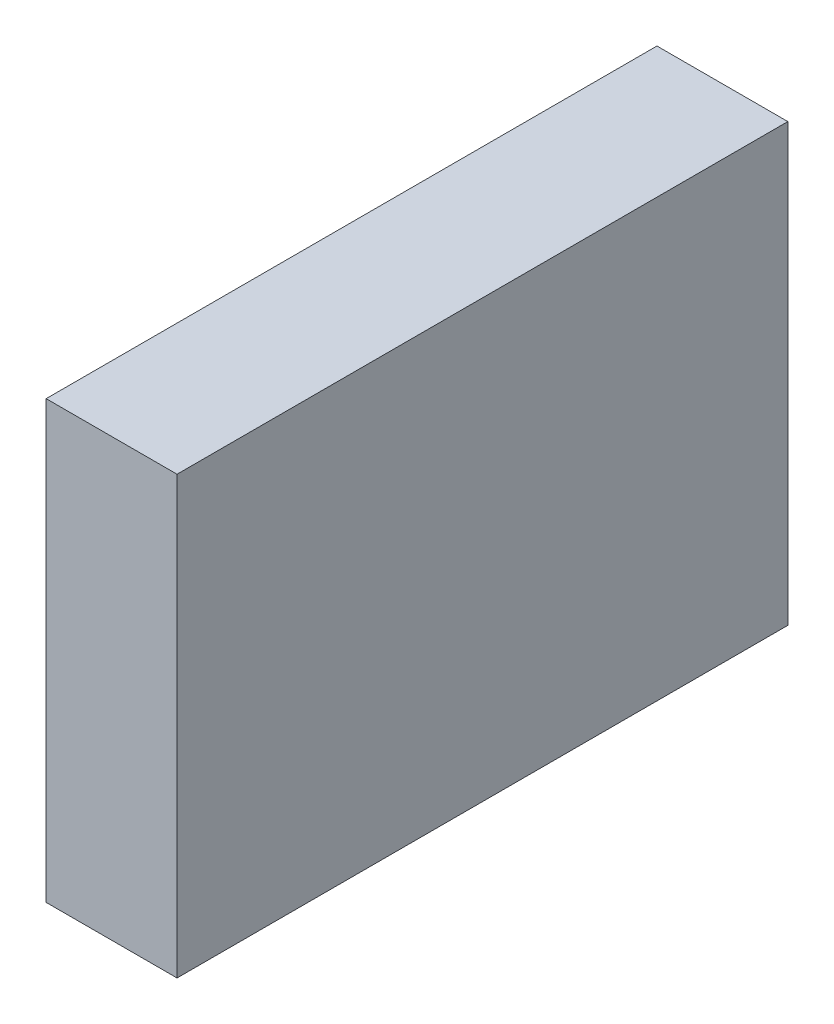
ISO-10303-21;
HEADER;
FILE_DESCRIPTION(('STEP AP214'),'2;1');
FILE_NAME('part.step','',(''),(''),'','','');
FILE_SCHEMA(('AUTOMOTIVE_DESIGN { 1 0 10303 214 1 1 1 1 }'));
ENDSEC;
DATA;
#1=APPLICATION_CONTEXT('core data for automotive mechanical design processes');
#2=APPLICATION_PROTOCOL_DEFINITION('international standard','automotive_design',2000,#1);
#3=PRODUCT_CONTEXT('',#1,'mechanical');
#4=PRODUCT('Part','Part','',(#3));
#5=PRODUCT_RELATED_PRODUCT_CATEGORY('part','',(#4));
#6=PRODUCT_DEFINITION_FORMATION('','',#4);
#7=PRODUCT_DEFINITION_CONTEXT('part definition',#1,'design');
#8=PRODUCT_DEFINITION('design','',#6,#7);
#9=PRODUCT_DEFINITION_SHAPE('','',#8);
#10=(LENGTH_UNIT() NAMED_UNIT(*) SI_UNIT(.MILLI.,.METRE.));
#11=(NAMED_UNIT(*) PLANE_ANGLE_UNIT() SI_UNIT($,.RADIAN.));
#12=(NAMED_UNIT(*) SI_UNIT($,.STERADIAN.) SOLID_ANGLE_UNIT());
#13=UNCERTAINTY_MEASURE_WITH_UNIT(LENGTH_MEASURE(1.E-05),#10,'distance_accuracy_value','');
#14=(GEOMETRIC_REPRESENTATION_CONTEXT(3) GLOBAL_UNCERTAINTY_ASSIGNED_CONTEXT((#13)) GLOBAL_UNIT_ASSIGNED_CONTEXT((#10,
#11,#12)) REPRESENTATION_CONTEXT('',''));
#15=CARTESIAN_POINT('',(0.,0.,0.));
#16=DIRECTION('',(0.,0.,1.));
#17=DIRECTION('',(1.,0.,0.));
#18=AXIS2_PLACEMENT_3D('',#15,#16,#17);
#19=CARTESIAN_POINT('',(-3.90000031821894,-1.81999949557058,-3.72112168010555));
#20=DIRECTION('',(1.,-1.74845553146952E-07,0.));
#21=DIRECTION('',(1.74845553146952E-07,1.,8.74227765734759E-08));
#22=AXIS2_PLACEMENT_3D('',#19,#20,#21);
#23=PLANE('',#22);
#24=DIRECTION('',(-1.74845553146599E-07,-0.999999999999981,-8.74227765732994E-08));
#25=VECTOR('',#24,1.);
#26=CARTESIAN_POINT('',(-3.90000013113422,-0.749999624080061,-2.25112158656318));
#27=LINE('',#26,#25);
#28=CARTESIAN_POINT('',(-3.90000013113422,-0.749999624081061,-2.25112158656318));
#29=VERTEX_POINT('',#28);
#30=CARTESIAN_POINT('',(-3.90000030597977,-1.74999962408206,-2.25112167398695));
#31=VERTEX_POINT('',#30);
#32=EDGE_CURVE('E11',#29,#31,#27,.T.);
#33=ORIENTED_EDGE('',*,*,#32,.T.);
#34=DIRECTION('',(0.,8.74227764783136E-08,-0.999999999999996));
#35=VECTOR('',#34,1.);
#36=CARTESIAN_POINT('',(-3.90000030597977,-1.74999962408206,-2.25112167398595));
#37=LINE('',#36,#35);
#38=CARTESIAN_POINT('',(-3.90000030597975,-1.74999950168917,-3.65112167398595));
#39=VERTEX_POINT('',#38);
#40=EDGE_CURVE('E69',#31,#39,#37,.T.);
#41=ORIENTED_EDGE('',*,*,#40,.T.);
#42=DIRECTION('',(1.74845553146599E-07,0.999999999999981,8.74227765732993E-08));
#43=VECTOR('',#42,1.);
#44=CARTESIAN_POINT('',(-3.90000030597975,-1.74999950169017,-3.65112167398595));
#45=LINE('',#44,#43);
#46=CARTESIAN_POINT('',(-3.9000001311342,-0.749999501688174,-3.65112158656218));
#47=VERTEX_POINT('',#46);
#48=EDGE_CURVE('E55',#39,#47,#45,.T.);
#49=ORIENTED_EDGE('',*,*,#48,.T.);
#50=DIRECTION('',(0.,-8.74227765576152E-08,0.999999999999996));
#51=VECTOR('',#50,1.);
#52=CARTESIAN_POINT('',(-3.9000001311342,-0.749999501688174,-3.65112158656318));
#53=LINE('',#52,#51);
#54=EDGE_CURVE('E53',#47,#29,#53,.T.);
#55=ORIENTED_EDGE('',*,*,#54,.T.);
#56=EDGE_LOOP('',(#33,#41,#49,#55));
#57=FACE_BOUND('',#56,.T.);
#58=ADVANCED_FACE('F17',(#57),#23,.T.);
#59=CARTESIAN_POINT('',(-4.20000031821894,-1.81999944311691,-3.72112168010555));
#60=DIRECTION('',(1.,-1.74845553146952E-07,0.));
#61=DIRECTION('',(1.74845553146952E-07,1.,8.74227765734759E-08));
#62=AXIS2_PLACEMENT_3D('',#59,#60,#61);
#63=PLANE('',#62);
#64=DIRECTION('',(0.,-8.74227765576152E-08,0.999999999999996));
#65=VECTOR('',#64,1.);
#66=CARTESIAN_POINT('',(-4.2000001311342,-0.749999449234508,-3.65112158656318));
#67=LINE('',#66,#65);
#68=CARTESIAN_POINT('',(-4.2000001311342,-0.749999449234508,-3.65112158656218));
#69=VERTEX_POINT('',#68);
#70=CARTESIAN_POINT('',(-4.20000013113422,-0.749999571627395,-2.25112158656318));
#71=VERTEX_POINT('',#70);
#72=EDGE_CURVE('E24',#69,#71,#67,.T.);
#73=ORIENTED_EDGE('',*,*,#72,.F.);
#74=DIRECTION('',(1.74845553146599E-07,0.999999999999981,8.74227765732993E-08));
#75=VECTOR('',#74,1.);
#76=CARTESIAN_POINT('',(-4.20000030597975,-1.74999944923651,-3.65112167398595));
#77=LINE('',#76,#75);
#78=CARTESIAN_POINT('',(-4.20000030597975,-1.74999944923551,-3.65112167398595));
#79=VERTEX_POINT('',#78);
#80=EDGE_CURVE('E70',#79,#69,#77,.T.);
#81=ORIENTED_EDGE('',*,*,#80,.F.);
#82=DIRECTION('',(0.,8.74227766369168E-08,-0.999999999999996));
#83=VECTOR('',#82,1.);
#84=CARTESIAN_POINT('',(-4.20000030597977,-1.74999957162839,-2.25112167398595));
#85=LINE('',#84,#83);
#86=CARTESIAN_POINT('',(-4.20000030597977,-1.74999957162839,-2.25112167398695));
#87=VERTEX_POINT('',#86);
#88=EDGE_CURVE('E59',#87,#79,#85,.T.);
#89=ORIENTED_EDGE('',*,*,#88,.F.);
#90=DIRECTION('',(-1.74845553146599E-07,-0.999999999999981,-8.74227765732993E-08));
#91=VECTOR('',#90,1.);
#92=CARTESIAN_POINT('',(-4.20000013113422,-0.749999571626395,-2.25112158656318));
#93=LINE('',#92,#91);
#94=EDGE_CURVE('E78',#71,#87,#93,.T.);
#95=ORIENTED_EDGE('',*,*,#94,.F.);
#96=EDGE_LOOP('',(#73,#81,#89,#95));
#97=FACE_BOUND('',#96,.T.);
#98=ADVANCED_FACE('F89',(#97),#63,.F.);
#99=CARTESIAN_POINT('',(-3.90000013113422,-0.749999624080061,-2.25112158656318));
#100=DIRECTION('',(0.,8.74227765734759E-08,-1.));
#101=DIRECTION('',(-1.74845553146952E-07,-1.,-8.74227765734759E-08));
#102=AXIS2_PLACEMENT_3D('',#99,#100,#101);
#103=PLANE('',#102);
#104=DIRECTION('',(-0.999999999999985,1.74845553220963E-07,0.));
#105=VECTOR('',#104,1.);
#106=CARTESIAN_POINT('',(-3.90000013113422,-0.749999624080061,-2.25112158656318));
#107=LINE('',#106,#105);
#108=EDGE_CURVE('E65',#29,#71,#107,.T.);
#109=ORIENTED_EDGE('',*,*,#108,.T.);
#110=ORIENTED_EDGE('',*,*,#94,.T.);
#111=DIRECTION('',(-0.999999999999985,1.74845552850889E-07,0.));
#112=VECTOR('',#111,1.);
#113=CARTESIAN_POINT('',(-3.90000030597977,-1.74999962408206,-2.25112167398595));
#114=LINE('',#113,#112);
#115=EDGE_CURVE('E66',#31,#87,#114,.T.);
#116=ORIENTED_EDGE('',*,*,#115,.F.);
#117=ORIENTED_EDGE('',*,*,#32,.F.);
#118=EDGE_LOOP('',(#109,#110,#116,#117));
#119=FACE_BOUND('',#118,.T.);
#120=ADVANCED_FACE('F63',(#119),#103,.F.);
#121=CARTESIAN_POINT('',(-3.90000030597977,-1.74999962408206,-2.25112167398595));
#122=DIRECTION('',(1.74845553146952E-07,1.,8.74227765734759E-08));
#123=DIRECTION('',(0.,8.74227765734759E-08,-1.));
#124=AXIS2_PLACEMENT_3D('',#121,#122,#123);
#125=PLANE('',#124);
#126=ORIENTED_EDGE('',*,*,#115,.T.);
#127=ORIENTED_EDGE('',*,*,#88,.T.);
#128=DIRECTION('',(-0.999999999999985,1.74845552850889E-07,0.));
#129=VECTOR('',#128,1.);
#130=CARTESIAN_POINT('',(-3.90000030597975,-1.74999950169017,-3.65112167398595));
#131=LINE('',#130,#129);
#132=EDGE_CURVE('E60',#39,#79,#131,.T.);
#133=ORIENTED_EDGE('',*,*,#132,.F.);
#134=ORIENTED_EDGE('',*,*,#40,.F.);
#135=EDGE_LOOP('',(#126,#127,#133,#134));
#136=FACE_BOUND('',#135,.T.);
#137=ADVANCED_FACE('F91',(#136),#125,.F.);
#138=CARTESIAN_POINT('',(-3.90000030597975,-1.74999950169017,-3.65112167398595));
#139=DIRECTION('',(0.,-8.74227765734759E-08,1.));
#140=DIRECTION('',(1.74845553146952E-07,1.,8.74227765734759E-08));
#141=AXIS2_PLACEMENT_3D('',#138,#139,#140);
#142=PLANE('',#141);
#143=ORIENTED_EDGE('',*,*,#132,.T.);
#144=ORIENTED_EDGE('',*,*,#80,.T.);
#145=DIRECTION('',(-0.999999999999985,1.74845553220963E-07,0.));
#146=VECTOR('',#145,1.);
#147=CARTESIAN_POINT('',(-3.9000001311342,-0.749999501688174,-3.65112158656318));
#148=LINE('',#147,#146);
#149=EDGE_CURVE('E84',#47,#69,#148,.T.);
#150=ORIENTED_EDGE('',*,*,#149,.F.);
#151=ORIENTED_EDGE('',*,*,#48,.F.);
#152=EDGE_LOOP('',(#143,#144,#150,#151));
#153=FACE_BOUND('',#152,.T.);
#154=ADVANCED_FACE('F86',(#153),#142,.F.);
#155=CARTESIAN_POINT('',(-3.9000001311342,-0.749999501688174,-3.65112158656318));
#156=DIRECTION('',(-1.74845553146952E-07,-1.,-8.74227765734759E-08));
#157=DIRECTION('',(0.,-8.74227765734759E-08,1.));
#158=AXIS2_PLACEMENT_3D('',#155,#156,#157);
#159=PLANE('',#158);
#160=ORIENTED_EDGE('',*,*,#149,.T.);
#161=ORIENTED_EDGE('',*,*,#72,.T.);
#162=ORIENTED_EDGE('',*,*,#108,.F.);
#163=ORIENTED_EDGE('',*,*,#54,.F.);
#164=EDGE_LOOP('',(#160,#161,#162,#163));
#165=FACE_BOUND('',#164,.T.);
#166=ADVANCED_FACE('F68',(#165),#159,.F.);
#167=CLOSED_SHELL('',(#58,#98,#120,#137,#154,#166));
#168=MANIFOLD_SOLID_BREP('B1',#167);
#169=ADVANCED_BREP_SHAPE_REPRESENTATION('',(#18,#168),#14);
#170=SHAPE_DEFINITION_REPRESENTATION(#9,#169);
ENDSEC;
END-ISO-10303-21;
